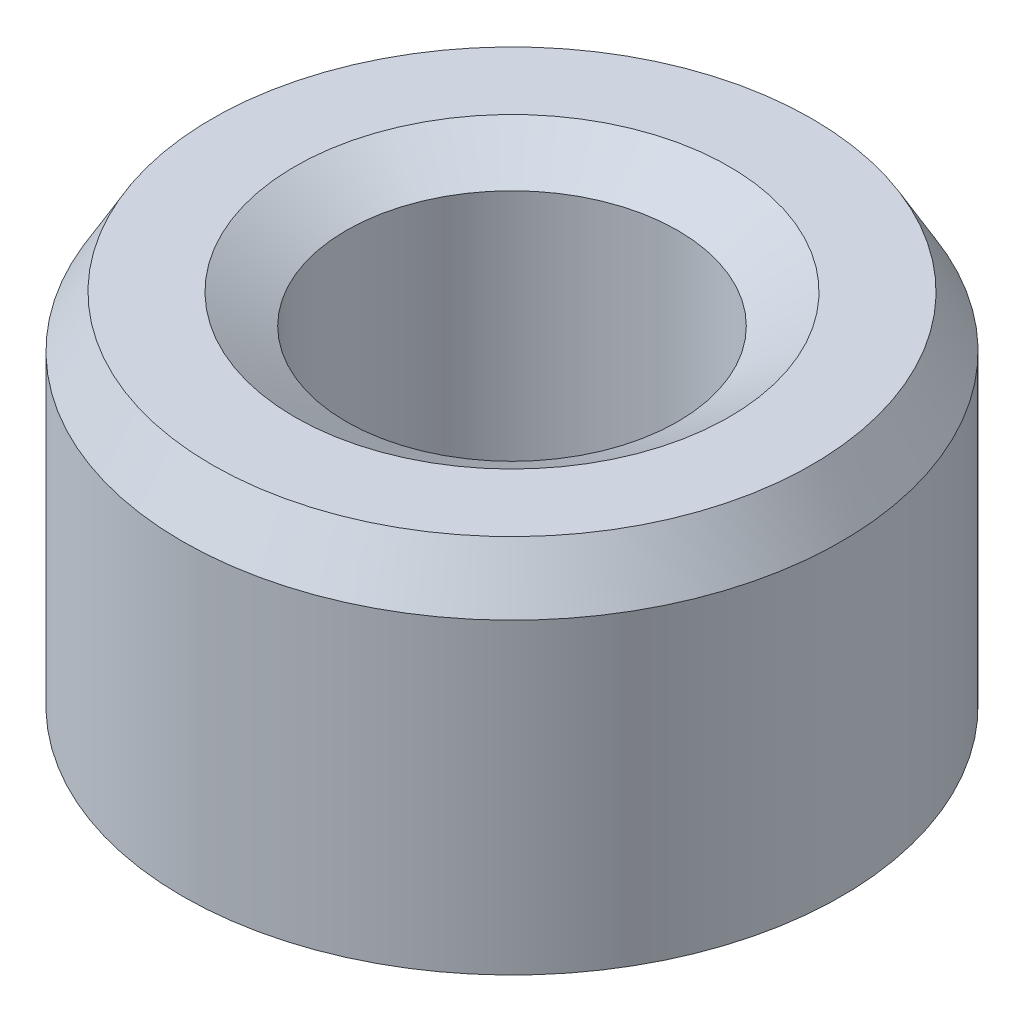
ISO-10303-21;
HEADER;
FILE_DESCRIPTION(('STEP AP214'),'2;1');
FILE_NAME('part.step','',(''),(''),'','','');
FILE_SCHEMA(('AUTOMOTIVE_DESIGN { 1 0 10303 214 1 1 1 1 }'));
ENDSEC;
DATA;
#1=APPLICATION_CONTEXT('core data for automotive mechanical design processes');
#2=APPLICATION_PROTOCOL_DEFINITION('international standard','automotive_design',2000,#1);
#3=PRODUCT_CONTEXT('',#1,'mechanical');
#4=PRODUCT('Part','Part','',(#3));
#5=PRODUCT_RELATED_PRODUCT_CATEGORY('part','',(#4));
#6=PRODUCT_DEFINITION_FORMATION('','',#4);
#7=PRODUCT_DEFINITION_CONTEXT('part definition',#1,'design');
#8=PRODUCT_DEFINITION('design','',#6,#7);
#9=PRODUCT_DEFINITION_SHAPE('','',#8);
#10=(LENGTH_UNIT() NAMED_UNIT(*) SI_UNIT(.MILLI.,.METRE.));
#11=(NAMED_UNIT(*) PLANE_ANGLE_UNIT() SI_UNIT($,.RADIAN.));
#12=(NAMED_UNIT(*) SI_UNIT($,.STERADIAN.) SOLID_ANGLE_UNIT());
#13=UNCERTAINTY_MEASURE_WITH_UNIT(LENGTH_MEASURE(1.E-05),#10,'distance_accuracy_value','');
#14=(GEOMETRIC_REPRESENTATION_CONTEXT(3) GLOBAL_UNCERTAINTY_ASSIGNED_CONTEXT((#13)) GLOBAL_UNIT_ASSIGNED_CONTEXT((#10,
#11,#12)) REPRESENTATION_CONTEXT('',''));
#15=CARTESIAN_POINT('',(0.,0.,0.));
#16=DIRECTION('',(0.,0.,1.));
#17=DIRECTION('',(1.,0.,0.));
#18=AXIS2_PLACEMENT_3D('',#15,#16,#17);
#19=CARTESIAN_POINT('',(0.,8.83941326037426,0.));
#20=DIRECTION('',(0.,-1.,0.));
#21=DIRECTION('',(0.,0.,-1.));
#22=AXIS2_PLACEMENT_3D('',#19,#20,#21);
#23=CYLINDRICAL_SURFACE('',#22,7.5);
#24=CARTESIAN_POINT('',(0.,0.675641720291782,0.));
#25=DIRECTION('',(0.,1.,0.));
#26=DIRECTION('',(0.,0.,1.));
#27=AXIS2_PLACEMENT_3D('',#24,#25,#26);
#28=CIRCLE('',#27,7.5);
#29=CARTESIAN_POINT('',(0.,0.675641720291782,7.5));
#30=VERTEX_POINT('',#29);
#31=EDGE_CURVE('E10',#30,#30,#28,.T.);
#32=ORIENTED_EDGE('',*,*,#31,.T.);
#33=EDGE_LOOP('',(#32));
#34=FACE_BOUND('',#33,.T.);
#35=CARTESIAN_POINT('',(0.,7.66916747311564,0.));
#36=DIRECTION('',(0.,1.,0.));
#37=DIRECTION('',(0.,0.,1.));
#38=AXIS2_PLACEMENT_3D('',#35,#36,#37);
#39=CIRCLE('',#38,7.5);
#40=CARTESIAN_POINT('',(0.,7.66916747311564,7.5));
#41=VERTEX_POINT('',#40);
#42=EDGE_CURVE('E50',#41,#41,#39,.F.);
#43=ORIENTED_EDGE('',*,*,#42,.T.);
#44=EDGE_LOOP('',(#43));
#45=FACE_BOUND('',#44,.T.);
#46=ADVANCED_FACE('F39',(#34,#45),#23,.T.);
#47=CARTESIAN_POINT('',(0.,8.83941326037426,0.));
#48=DIRECTION('',(0.,1.,0.));
#49=DIRECTION('',(0.,0.,1.));
#50=AXIS2_PLACEMENT_3D('',#47,#48,#49);
#51=PLANE('',#50);
#52=CARTESIAN_POINT('',(0.,8.83941326037426,0.));
#53=DIRECTION('',(0.,1.,0.));
#54=DIRECTION('',(0.,0.,1.));
#55=AXIS2_PLACEMENT_3D('',#52,#53,#54);
#56=CIRCLE('',#55,4.94124702972043);
#57=CARTESIAN_POINT('',(0.,8.83941326037426,4.94124702972043));
#58=VERTEX_POINT('',#57);
#59=EDGE_CURVE('E58',#58,#58,#56,.F.);
#60=ORIENTED_EDGE('',*,*,#59,.T.);
#61=EDGE_LOOP('',(#60));
#62=FACE_BOUND('',#61,.T.);
#63=CARTESIAN_POINT('',(0.,8.83941326037426,0.));
#64=DIRECTION('',(0.,1.,0.));
#65=DIRECTION('',(0.,0.,1.));
#66=AXIS2_PLACEMENT_3D('',#63,#64,#65);
#67=CIRCLE('',#66,6.82435827970822);
#68=CARTESIAN_POINT('',(0.,8.83941326037426,6.82435827970822));
#69=VERTEX_POINT('',#68);
#70=EDGE_CURVE('E61',#69,#69,#67,.T.);
#71=ORIENTED_EDGE('',*,*,#70,.T.);
#72=EDGE_LOOP('',(#71));
#73=FACE_BOUND('',#72,.T.);
#74=ADVANCED_FACE('F88',(#62,#73),#51,.T.);
#75=CARTESIAN_POINT('',(0.,0.,0.));
#76=DIRECTION('',(0.,1.,0.));
#77=DIRECTION('',(0.,0.,1.));
#78=AXIS2_PLACEMENT_3D('',#75,#76,#77);
#79=PLANE('',#78);
#80=CARTESIAN_POINT('',(0.,0.,0.));
#81=DIRECTION('',(0.,1.,0.));
#82=DIRECTION('',(0.,0.,1.));
#83=AXIS2_PLACEMENT_3D('',#80,#81,#82);
#84=CIRCLE('',#83,4.44664296275359);
#85=CARTESIAN_POINT('',(0.,0.,4.44664296275359));
#86=VERTEX_POINT('',#85);
#87=EDGE_CURVE('E51',#86,#86,#84,.T.);
#88=ORIENTED_EDGE('',*,*,#87,.T.);
#89=EDGE_LOOP('',(#88));
#90=FACE_BOUND('',#89,.T.);
#91=CARTESIAN_POINT('',(0.,0.,0.));
#92=DIRECTION('',(0.,1.,0.));
#93=DIRECTION('',(0.,0.,1.));
#94=AXIS2_PLACEMENT_3D('',#91,#92,#93);
#95=CIRCLE('',#94,6.32975421274138);
#96=CARTESIAN_POINT('',(0.,0.,6.32975421274138));
#97=VERTEX_POINT('',#96);
#98=EDGE_CURVE('E54',#97,#97,#95,.F.);
#99=ORIENTED_EDGE('',*,*,#98,.T.);
#100=EDGE_LOOP('',(#99));
#101=FACE_BOUND('',#100,.T.);
#102=ADVANCED_FACE('F83',(#90,#101),#79,.F.);
#103=CARTESIAN_POINT('',(0.,8.83941326037426,0.));
#104=DIRECTION('',(0.,-1.,0.));
#105=DIRECTION('',(0.,0.,-1.));
#106=AXIS2_PLACEMENT_3D('',#103,#104,#105);
#107=CYLINDRICAL_SURFACE('',#106,3.77100124246181);
#108=CARTESIAN_POINT('',(0.,8.16377154008248,0.));
#109=DIRECTION('',(0.,1.,0.));
#110=DIRECTION('',(0.,0.,1.));
#111=AXIS2_PLACEMENT_3D('',#108,#109,#110);
#112=CIRCLE('',#111,3.77100124246181);
#113=CARTESIAN_POINT('',(0.,8.16377154008248,3.77100124246181));
#114=VERTEX_POINT('',#113);
#115=EDGE_CURVE('E67',#114,#114,#112,.T.);
#116=ORIENTED_EDGE('',*,*,#115,.T.);
#117=EDGE_LOOP('',(#116));
#118=FACE_BOUND('',#117,.T.);
#119=CARTESIAN_POINT('',(0.,1.17024578725861,0.));
#120=DIRECTION('',(0.,1.,0.));
#121=DIRECTION('',(0.,0.,1.));
#122=AXIS2_PLACEMENT_3D('',#119,#120,#121);
#123=CIRCLE('',#122,3.77100124246181);
#124=CARTESIAN_POINT('',(0.,1.17024578725861,3.77100124246181));
#125=VERTEX_POINT('',#124);
#126=EDGE_CURVE('E69',#125,#125,#123,.F.);
#127=ORIENTED_EDGE('',*,*,#126,.T.);
#128=EDGE_LOOP('',(#127));
#129=FACE_BOUND('',#128,.T.);
#130=ADVANCED_FACE('F71',(#118,#129),#107,.F.);
#131=CARTESIAN_POINT('',(0.,8.16377154008248,0.));
#132=DIRECTION('',(0.,1.,0.));
#133=DIRECTION('',(0.,0.,1.));
#134=AXIS2_PLACEMENT_3D('',#131,#132,#133);
#135=CONICAL_SURFACE('',#134,3.77100124246181,1.0471975511966);
#136=ORIENTED_EDGE('',*,*,#59,.F.);
#137=EDGE_LOOP('',(#136));
#138=FACE_BOUND('',#137,.T.);
#139=ORIENTED_EDGE('',*,*,#115,.F.);
#140=EDGE_LOOP('',(#139));
#141=FACE_BOUND('',#140,.T.);
#142=ADVANCED_FACE('F77',(#138,#141),#135,.F.);
#143=CARTESIAN_POINT('',(0.,0.,0.));
#144=DIRECTION('',(0.,-1.,0.));
#145=DIRECTION('',(0.,0.,-1.));
#146=AXIS2_PLACEMENT_3D('',#143,#144,#145);
#147=CONICAL_SURFACE('',#146,4.44664296275359,0.523598775598296);
#148=ORIENTED_EDGE('',*,*,#126,.F.);
#149=EDGE_LOOP('',(#148));
#150=FACE_BOUND('',#149,.T.);
#151=ORIENTED_EDGE('',*,*,#87,.F.);
#152=EDGE_LOOP('',(#151));
#153=FACE_BOUND('',#152,.T.);
#154=ADVANCED_FACE('F73',(#150,#153),#147,.F.);
#155=CARTESIAN_POINT('',(0.,0.675641720291782,0.));
#156=DIRECTION('',(0.,1.,0.));
#157=DIRECTION('',(0.,0.,1.));
#158=AXIS2_PLACEMENT_3D('',#155,#156,#157);
#159=CONICAL_SURFACE('',#158,7.5,1.0471975511966);
#160=ORIENTED_EDGE('',*,*,#98,.F.);
#161=EDGE_LOOP('',(#160));
#162=FACE_BOUND('',#161,.T.);
#163=ORIENTED_EDGE('',*,*,#31,.F.);
#164=EDGE_LOOP('',(#163));
#165=FACE_BOUND('',#164,.T.);
#166=ADVANCED_FACE('F76',(#162,#165),#159,.T.);
#167=CARTESIAN_POINT('',(0.,8.83941326037426,0.));
#168=DIRECTION('',(0.,-1.,0.));
#169=DIRECTION('',(0.,0.,-1.));
#170=AXIS2_PLACEMENT_3D('',#167,#168,#169);
#171=CONICAL_SURFACE('',#170,6.82435827970822,0.523598775598294);
#172=ORIENTED_EDGE('',*,*,#42,.F.);
#173=EDGE_LOOP('',(#172));
#174=FACE_BOUND('',#173,.T.);
#175=ORIENTED_EDGE('',*,*,#70,.F.);
#176=EDGE_LOOP('',(#175));
#177=FACE_BOUND('',#176,.T.);
#178=ADVANCED_FACE('F45',(#174,#177),#171,.T.);
#179=CLOSED_SHELL('',(#46,#74,#102,#130,#142,#154,#166,#178));
#180=MANIFOLD_SOLID_BREP('B2',#179);
#181=ADVANCED_BREP_SHAPE_REPRESENTATION('',(#18,#180),#14);
#182=SHAPE_DEFINITION_REPRESENTATION(#9,#181);
ENDSEC;
END-ISO-10303-21;
